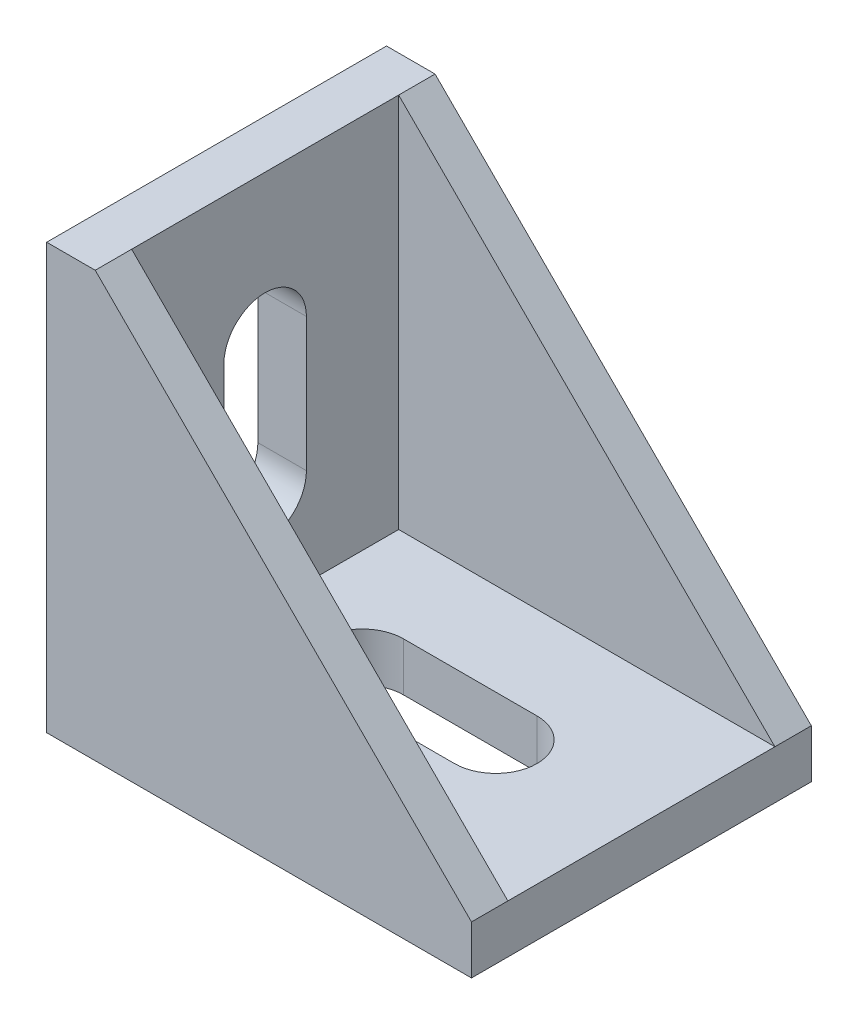
ISO-10303-21;
HEADER;
FILE_DESCRIPTION(('STEP AP214'),'2;1');
FILE_NAME('part.step','',(''),(''),'','','');
FILE_SCHEMA(('AUTOMOTIVE_DESIGN { 1 0 10303 214 1 1 1 1 }'));
ENDSEC;
DATA;
#1=APPLICATION_CONTEXT('core data for automotive mechanical design processes');
#2=APPLICATION_PROTOCOL_DEFINITION('international standard','automotive_design',2000,#1);
#3=PRODUCT_CONTEXT('',#1,'mechanical');
#4=PRODUCT('Part','Part','',(#3));
#5=PRODUCT_RELATED_PRODUCT_CATEGORY('part','',(#4));
#6=PRODUCT_DEFINITION_FORMATION('','',#4);
#7=PRODUCT_DEFINITION_CONTEXT('part definition',#1,'design');
#8=PRODUCT_DEFINITION('design','',#6,#7);
#9=PRODUCT_DEFINITION_SHAPE('','',#8);
#10=(LENGTH_UNIT() NAMED_UNIT(*) SI_UNIT(.MILLI.,.METRE.));
#11=(NAMED_UNIT(*) PLANE_ANGLE_UNIT() SI_UNIT($,.RADIAN.));
#12=(NAMED_UNIT(*) SI_UNIT($,.STERADIAN.) SOLID_ANGLE_UNIT());
#13=UNCERTAINTY_MEASURE_WITH_UNIT(LENGTH_MEASURE(1.E-05),#10,'distance_accuracy_value','');
#14=(GEOMETRIC_REPRESENTATION_CONTEXT(3) GLOBAL_UNCERTAINTY_ASSIGNED_CONTEXT((#13)) GLOBAL_UNIT_ASSIGNED_CONTEXT((#10,
#11,#12)) REPRESENTATION_CONTEXT('',''));
#15=CARTESIAN_POINT('',(0.,0.,0.));
#16=DIRECTION('',(0.,0.,1.));
#17=DIRECTION('',(1.,0.,0.));
#18=AXIS2_PLACEMENT_3D('',#15,#16,#17);
#19=CARTESIAN_POINT('',(4.,35.,14.));
#20=DIRECTION('',(-1.,0.,0.));
#21=DIRECTION('',(0.,-1.,0.));
#22=AXIS2_PLACEMENT_3D('',#19,#20,#21);
#23=PLANE('',#22);
#24=DIRECTION('',(0.,-1.,0.));
#25=VECTOR('',#24,1.);
#26=CARTESIAN_POINT('',(4.,4.,-11.));
#27=LINE('',#26,#25);
#28=CARTESIAN_POINT('',(4.,35.,-11.));
#29=VERTEX_POINT('',#28);
#30=CARTESIAN_POINT('',(4.,4.,-11.));
#31=VERTEX_POINT('',#30);
#32=EDGE_CURVE('E455',#29,#31,#27,.T.);
#33=ORIENTED_EDGE('',*,*,#32,.F.);
#34=DIRECTION('',(0.,0.,-1.));
#35=VECTOR('',#34,1.);
#36=CARTESIAN_POINT('',(4.,35.,14.));
#37=LINE('',#36,#35);
#38=CARTESIAN_POINT('',(4.,35.,11.));
#39=VERTEX_POINT('',#38);
#40=EDGE_CURVE('E495',#39,#29,#37,.T.);
#41=ORIENTED_EDGE('',*,*,#40,.F.);
#42=DIRECTION('',(0.,-1.,0.));
#43=VECTOR('',#42,1.);
#44=CARTESIAN_POINT('',(4.,4.,11.));
#45=LINE('',#44,#43);
#46=CARTESIAN_POINT('',(4.,4.,11.));
#47=VERTEX_POINT('',#46);
#48=EDGE_CURVE('E472',#39,#47,#45,.T.);
#49=ORIENTED_EDGE('',*,*,#48,.T.);
#50=DIRECTION('',(0.,0.,-1.));
#51=VECTOR('',#50,1.);
#52=CARTESIAN_POINT('',(4.,4.,14.));
#53=LINE('',#52,#51);
#54=EDGE_CURVE('E506',#47,#31,#53,.T.);
#55=ORIENTED_EDGE('',*,*,#54,.T.);
#56=EDGE_LOOP('',(#33,#41,#49,#55));
#57=FACE_BOUND('',#56,.T.);
#58=CARTESIAN_POINT('',(4.,12.,0.));
#59=DIRECTION('',(-1.,0.,0.));
#60=DIRECTION('',(0.,0.,1.));
#61=AXIS2_PLACEMENT_3D('',#58,#59,#60);
#62=CIRCLE('',#61,3.4);
#63=CARTESIAN_POINT('',(4.,12.,-3.4));
#64=VERTEX_POINT('',#63);
#65=CARTESIAN_POINT('',(4.,12.,3.4));
#66=VERTEX_POINT('',#65);
#67=EDGE_CURVE('E325',#64,#66,#62,.T.);
#68=ORIENTED_EDGE('',*,*,#67,.T.);
#69=DIRECTION('',(0.,1.,0.));
#70=VECTOR('',#69,1.);
#71=CARTESIAN_POINT('',(4.,12.,3.4));
#72=LINE('',#71,#70);
#73=CARTESIAN_POINT('',(4.00000000000001,23.,3.4));
#74=VERTEX_POINT('',#73);
#75=EDGE_CURVE('E329',#66,#74,#72,.T.);
#76=ORIENTED_EDGE('',*,*,#75,.T.);
#77=CARTESIAN_POINT('',(4.00000000000001,23.,0.));
#78=DIRECTION('',(-1.,0.,0.));
#79=DIRECTION('',(0.,0.,1.));
#80=AXIS2_PLACEMENT_3D('',#77,#78,#79);
#81=CIRCLE('',#80,3.4);
#82=CARTESIAN_POINT('',(4.00000000000001,23.,-3.4));
#83=VERTEX_POINT('',#82);
#84=EDGE_CURVE('E342',#74,#83,#81,.T.);
#85=ORIENTED_EDGE('',*,*,#84,.T.);
#86=DIRECTION('',(0.,-1.,0.));
#87=VECTOR('',#86,1.);
#88=CARTESIAN_POINT('',(4.,12.,-3.4));
#89=LINE('',#88,#87);
#90=EDGE_CURVE('E339',#83,#64,#89,.T.);
#91=ORIENTED_EDGE('',*,*,#90,.T.);
#92=EDGE_LOOP('',(#68,#76,#85,#91));
#93=FACE_BOUND('',#92,.T.);
#94=ADVANCED_FACE('F46',(#57,#93),#23,.F.);
#95=CARTESIAN_POINT('',(0.,35.,14.));
#96=DIRECTION('',(1.,0.,0.));
#97=DIRECTION('',(0.,1.,0.));
#98=AXIS2_PLACEMENT_3D('',#95,#96,#97);
#99=PLANE('',#98);
#100=DIRECTION('',(0.,1.,0.));
#101=VECTOR('',#100,1.);
#102=CARTESIAN_POINT('',(0.,29.5,-4.));
#103=LINE('',#102,#101);
#104=CARTESIAN_POINT('',(0.,29.5,-4.));
#105=VERTEX_POINT('',#104);
#106=CARTESIAN_POINT('',(0.,32.,-4.));
#107=VERTEX_POINT('',#106);
#108=EDGE_CURVE('E287',#105,#107,#103,.T.);
#109=ORIENTED_EDGE('',*,*,#108,.T.);
#110=DIRECTION('',(0.,0.,1.));
#111=VECTOR('',#110,1.);
#112=CARTESIAN_POINT('',(0.,32.,-4.));
#113=LINE('',#112,#111);
#114=CARTESIAN_POINT('',(0.,32.,4.));
#115=VERTEX_POINT('',#114);
#116=EDGE_CURVE('E261',#107,#115,#113,.T.);
#117=ORIENTED_EDGE('',*,*,#116,.T.);
#118=DIRECTION('',(0.,-1.,0.));
#119=VECTOR('',#118,1.);
#120=CARTESIAN_POINT('',(0.,29.5,4.));
#121=LINE('',#120,#119);
#122=CARTESIAN_POINT('',(0.,29.5,4.));
#123=VERTEX_POINT('',#122);
#124=EDGE_CURVE('E277',#115,#123,#121,.T.);
#125=ORIENTED_EDGE('',*,*,#124,.T.);
#126=DIRECTION('',(0.,0.,-1.));
#127=VECTOR('',#126,1.);
#128=CARTESIAN_POINT('',(0.,29.5,-4.));
#129=LINE('',#128,#127);
#130=EDGE_CURVE('E61',#123,#105,#129,.T.);
#131=ORIENTED_EDGE('',*,*,#130,.T.);
#132=EDGE_LOOP('',(#109,#117,#125,#131));
#133=FACE_BOUND('',#132,.T.);
#134=DIRECTION('',(0.,1.,0.));
#135=VECTOR('',#134,1.);
#136=CARTESIAN_POINT('',(0.,3.,-4.));
#137=LINE('',#136,#135);
#138=CARTESIAN_POINT('',(0.,3.,-4.));
#139=VERTEX_POINT('',#138);
#140=CARTESIAN_POINT('',(0.,5.5,-4.));
#141=VERTEX_POINT('',#140);
#142=EDGE_CURVE('E312',#139,#141,#137,.T.);
#143=ORIENTED_EDGE('',*,*,#142,.T.);
#144=DIRECTION('',(0.,0.,1.));
#145=VECTOR('',#144,1.);
#146=CARTESIAN_POINT('',(0.,5.5,-4.));
#147=LINE('',#146,#145);
#148=CARTESIAN_POINT('',(0.,5.5,4.));
#149=VERTEX_POINT('',#148);
#150=EDGE_CURVE('E266',#141,#149,#147,.T.);
#151=ORIENTED_EDGE('',*,*,#150,.T.);
#152=DIRECTION('',(0.,-1.,0.));
#153=VECTOR('',#152,1.);
#154=CARTESIAN_POINT('',(0.,3.,4.));
#155=LINE('',#154,#153);
#156=CARTESIAN_POINT('',(0.,3.,4.));
#157=VERTEX_POINT('',#156);
#158=EDGE_CURVE('E300',#149,#157,#155,.T.);
#159=ORIENTED_EDGE('',*,*,#158,.T.);
#160=DIRECTION('',(0.,0.,-1.));
#161=VECTOR('',#160,1.);
#162=CARTESIAN_POINT('',(0.,3.,-4.));
#163=LINE('',#162,#161);
#164=EDGE_CURVE('E69',#157,#139,#163,.T.);
#165=ORIENTED_EDGE('',*,*,#164,.T.);
#166=EDGE_LOOP('',(#143,#151,#159,#165));
#167=FACE_BOUND('',#166,.T.);
#168=DIRECTION('',(0.,-1.,0.));
#169=VECTOR('',#168,1.);
#170=CARTESIAN_POINT('',(0.,35.,-14.));
#171=LINE('',#170,#169);
#172=CARTESIAN_POINT('',(0.,35.,-14.));
#173=VERTEX_POINT('',#172);
#174=CARTESIAN_POINT('',(0.,0.,-14.));
#175=VERTEX_POINT('',#174);
#176=EDGE_CURVE('E498',#173,#175,#171,.T.);
#177=ORIENTED_EDGE('',*,*,#176,.T.);
#178=DIRECTION('',(0.,0.,-1.));
#179=VECTOR('',#178,1.);
#180=CARTESIAN_POINT('',(0.,0.,14.));
#181=LINE('',#180,#179);
#182=CARTESIAN_POINT('',(0.,0.,14.));
#183=VERTEX_POINT('',#182);
#184=EDGE_CURVE('E54',#183,#175,#181,.T.);
#185=ORIENTED_EDGE('',*,*,#184,.F.);
#186=DIRECTION('',(0.,-1.,0.));
#187=VECTOR('',#186,1.);
#188=CARTESIAN_POINT('',(0.,35.,14.));
#189=LINE('',#188,#187);
#190=CARTESIAN_POINT('',(0.,35.,14.));
#191=VERTEX_POINT('',#190);
#192=EDGE_CURVE('E487',#191,#183,#189,.T.);
#193=ORIENTED_EDGE('',*,*,#192,.F.);
#194=DIRECTION('',(0.,0.,-1.));
#195=VECTOR('',#194,1.);
#196=CARTESIAN_POINT('',(0.,35.,14.));
#197=LINE('',#196,#195);
#198=EDGE_CURVE('E13',#191,#173,#197,.T.);
#199=ORIENTED_EDGE('',*,*,#198,.T.);
#200=EDGE_LOOP('',(#177,#185,#193,#199));
#201=FACE_BOUND('',#200,.T.);
#202=CARTESIAN_POINT('',(0.,12.,0.));
#203=DIRECTION('',(-1.,0.,0.));
#204=DIRECTION('',(0.,0.,1.));
#205=AXIS2_PLACEMENT_3D('',#202,#203,#204);
#206=CIRCLE('',#205,3.4);
#207=CARTESIAN_POINT('',(0.,12.,-3.4));
#208=VERTEX_POINT('',#207);
#209=CARTESIAN_POINT('',(0.,12.,3.4));
#210=VERTEX_POINT('',#209);
#211=EDGE_CURVE('E326',#208,#210,#206,.T.);
#212=ORIENTED_EDGE('',*,*,#211,.F.);
#213=DIRECTION('',(0.,-1.,0.));
#214=VECTOR('',#213,1.);
#215=CARTESIAN_POINT('',(0.,12.,-3.4));
#216=LINE('',#215,#214);
#217=CARTESIAN_POINT('',(0.,23.,-3.4));
#218=VERTEX_POINT('',#217);
#219=EDGE_CURVE('E328',#218,#208,#216,.T.);
#220=ORIENTED_EDGE('',*,*,#219,.F.);
#221=CARTESIAN_POINT('',(0.,23.,0.));
#222=DIRECTION('',(-1.,0.,0.));
#223=DIRECTION('',(0.,0.,1.));
#224=AXIS2_PLACEMENT_3D('',#221,#222,#223);
#225=CIRCLE('',#224,3.4);
#226=CARTESIAN_POINT('',(0.,23.,3.4));
#227=VERTEX_POINT('',#226);
#228=EDGE_CURVE('E331',#227,#218,#225,.T.);
#229=ORIENTED_EDGE('',*,*,#228,.F.);
#230=DIRECTION('',(0.,1.,0.));
#231=VECTOR('',#230,1.);
#232=CARTESIAN_POINT('',(0.,12.,3.4));
#233=LINE('',#232,#231);
#234=EDGE_CURVE('E334',#210,#227,#233,.T.);
#235=ORIENTED_EDGE('',*,*,#234,.F.);
#236=EDGE_LOOP('',(#212,#220,#229,#235));
#237=FACE_BOUND('',#236,.T.);
#238=ADVANCED_FACE('F556',(#133,#167,#201,#237),#99,.F.);
#239=CARTESIAN_POINT('',(0.,0.,14.));
#240=DIRECTION('',(0.,1.,0.));
#241=DIRECTION('',(0.,0.,1.));
#242=AXIS2_PLACEMENT_3D('',#239,#240,#241);
#243=PLANE('',#242);
#244=DIRECTION('',(0.,0.,1.));
#245=VECTOR('',#244,1.);
#246=CARTESIAN_POINT('',(5.5,0.,-4.));
#247=LINE('',#246,#245);
#248=CARTESIAN_POINT('',(5.5,0.,-4.));
#249=VERTEX_POINT('',#248);
#250=CARTESIAN_POINT('',(5.5,0.,4.));
#251=VERTEX_POINT('',#250);
#252=EDGE_CURVE('E389',#249,#251,#247,.T.);
#253=ORIENTED_EDGE('',*,*,#252,.F.);
#254=DIRECTION('',(1.,0.,0.));
#255=VECTOR('',#254,1.);
#256=CARTESIAN_POINT('',(3.,0.,-4.));
#257=LINE('',#256,#255);
#258=CARTESIAN_POINT('',(3.,0.,-4.));
#259=VERTEX_POINT('',#258);
#260=EDGE_CURVE('E394',#259,#249,#257,.T.);
#261=ORIENTED_EDGE('',*,*,#260,.F.);
#262=DIRECTION('',(0.,0.,-1.));
#263=VECTOR('',#262,1.);
#264=CARTESIAN_POINT('',(3.,0.,-4.));
#265=LINE('',#264,#263);
#266=CARTESIAN_POINT('',(3.,0.,4.));
#267=VERTEX_POINT('',#266);
#268=EDGE_CURVE('E406',#267,#259,#265,.T.);
#269=ORIENTED_EDGE('',*,*,#268,.F.);
#270=DIRECTION('',(-1.,0.,0.));
#271=VECTOR('',#270,1.);
#272=CARTESIAN_POINT('',(3.,0.,4.));
#273=LINE('',#272,#271);
#274=EDGE_CURVE('E403',#251,#267,#273,.T.);
#275=ORIENTED_EDGE('',*,*,#274,.F.);
#276=EDGE_LOOP('',(#253,#261,#269,#275));
#277=FACE_BOUND('',#276,.T.);
#278=DIRECTION('',(-1.,0.,0.));
#279=VECTOR('',#278,1.);
#280=CARTESIAN_POINT('',(12.,0.,-3.4));
#281=LINE('',#280,#279);
#282=CARTESIAN_POINT('',(23.,0.,-3.4));
#283=VERTEX_POINT('',#282);
#284=CARTESIAN_POINT('',(12.,0.,-3.4));
#285=VERTEX_POINT('',#284);
#286=EDGE_CURVE('E433',#283,#285,#281,.T.);
#287=ORIENTED_EDGE('',*,*,#286,.T.);
#288=CARTESIAN_POINT('',(12.,0.,0.));
#289=DIRECTION('',(0.,1.,0.));
#290=DIRECTION('',(0.,0.,1.));
#291=AXIS2_PLACEMENT_3D('',#288,#289,#290);
#292=CIRCLE('',#291,3.4);
#293=CARTESIAN_POINT('',(12.,0.,3.4));
#294=VERTEX_POINT('',#293);
#295=EDGE_CURVE('E423',#285,#294,#292,.T.);
#296=ORIENTED_EDGE('',*,*,#295,.T.);
#297=DIRECTION('',(1.,0.,0.));
#298=VECTOR('',#297,1.);
#299=CARTESIAN_POINT('',(12.,0.,3.4));
#300=LINE('',#299,#298);
#301=CARTESIAN_POINT('',(23.,0.,3.4));
#302=VERTEX_POINT('',#301);
#303=EDGE_CURVE('E426',#294,#302,#300,.T.);
#304=ORIENTED_EDGE('',*,*,#303,.T.);
#305=CARTESIAN_POINT('',(23.,0.,0.));
#306=DIRECTION('',(0.,1.,0.));
#307=DIRECTION('',(0.,0.,1.));
#308=AXIS2_PLACEMENT_3D('',#305,#306,#307);
#309=CIRCLE('',#308,3.4);
#310=EDGE_CURVE('E430',#302,#283,#309,.T.);
#311=ORIENTED_EDGE('',*,*,#310,.T.);
#312=EDGE_LOOP('',(#287,#296,#304,#311));
#313=FACE_BOUND('',#312,.T.);
#314=DIRECTION('',(1.,0.,0.));
#315=VECTOR('',#314,1.);
#316=CARTESIAN_POINT('',(0.,0.,-14.));
#317=LINE('',#316,#315);
#318=CARTESIAN_POINT('',(35.,0.,-14.));
#319=VERTEX_POINT('',#318);
#320=EDGE_CURVE('E500',#175,#319,#317,.T.);
#321=ORIENTED_EDGE('',*,*,#320,.T.);
#322=DIRECTION('',(0.,0.,-1.));
#323=VECTOR('',#322,1.);
#324=CARTESIAN_POINT('',(35.,0.,14.));
#325=LINE('',#324,#323);
#326=CARTESIAN_POINT('',(35.,0.,14.));
#327=VERTEX_POINT('',#326);
#328=EDGE_CURVE('E512',#327,#319,#325,.T.);
#329=ORIENTED_EDGE('',*,*,#328,.F.);
#330=DIRECTION('',(1.,0.,0.));
#331=VECTOR('',#330,1.);
#332=CARTESIAN_POINT('',(0.,0.,14.));
#333=LINE('',#332,#331);
#334=EDGE_CURVE('E490',#183,#327,#333,.T.);
#335=ORIENTED_EDGE('',*,*,#334,.F.);
#336=ORIENTED_EDGE('',*,*,#184,.T.);
#337=EDGE_LOOP('',(#321,#329,#335,#336));
#338=FACE_BOUND('',#337,.T.);
#339=DIRECTION('',(0.,0.,1.));
#340=VECTOR('',#339,1.);
#341=CARTESIAN_POINT('',(32.,0.,-4.));
#342=LINE('',#341,#340);
#343=CARTESIAN_POINT('',(32.,0.,-4.));
#344=VERTEX_POINT('',#343);
#345=CARTESIAN_POINT('',(32.,0.,4.));
#346=VERTEX_POINT('',#345);
#347=EDGE_CURVE('E350',#344,#346,#342,.T.);
#348=ORIENTED_EDGE('',*,*,#347,.F.);
#349=DIRECTION('',(1.,0.,0.));
#350=VECTOR('',#349,1.);
#351=CARTESIAN_POINT('',(29.5,0.,-4.));
#352=LINE('',#351,#350);
#353=CARTESIAN_POINT('',(29.5,0.,-4.));
#354=VERTEX_POINT('',#353);
#355=EDGE_CURVE('E361',#354,#344,#352,.T.);
#356=ORIENTED_EDGE('',*,*,#355,.F.);
#357=DIRECTION('',(0.,0.,-1.));
#358=VECTOR('',#357,1.);
#359=CARTESIAN_POINT('',(29.5,0.,-4.));
#360=LINE('',#359,#358);
#361=CARTESIAN_POINT('',(29.5,0.,4.));
#362=VERTEX_POINT('',#361);
#363=EDGE_CURVE('E373',#362,#354,#360,.T.);
#364=ORIENTED_EDGE('',*,*,#363,.F.);
#365=DIRECTION('',(-1.,0.,0.));
#366=VECTOR('',#365,1.);
#367=CARTESIAN_POINT('',(29.5,0.,4.));
#368=LINE('',#367,#366);
#369=EDGE_CURVE('E370',#346,#362,#368,.T.);
#370=ORIENTED_EDGE('',*,*,#369,.F.);
#371=EDGE_LOOP('',(#348,#356,#364,#370));
#372=FACE_BOUND('',#371,.T.);
#373=ADVANCED_FACE('F519',(#277,#313,#338,#372),#243,.F.);
#374=CARTESIAN_POINT('',(4.,4.,14.));
#375=DIRECTION('',(0.,-1.,0.));
#376=DIRECTION('',(0.,0.,-1.));
#377=AXIS2_PLACEMENT_3D('',#374,#375,#376);
#378=PLANE('',#377);
#379=DIRECTION('',(1.,0.,0.));
#380=VECTOR('',#379,1.);
#381=CARTESIAN_POINT('',(12.,4.,3.4));
#382=LINE('',#381,#380);
#383=CARTESIAN_POINT('',(12.,4.,3.4));
#384=VERTEX_POINT('',#383);
#385=CARTESIAN_POINT('',(23.,4.,3.4));
#386=VERTEX_POINT('',#385);
#387=EDGE_CURVE('E438',#384,#386,#382,.T.);
#388=ORIENTED_EDGE('',*,*,#387,.F.);
#389=CARTESIAN_POINT('',(12.,4.,0.));
#390=DIRECTION('',(0.,1.,0.));
#391=DIRECTION('',(0.,0.,1.));
#392=AXIS2_PLACEMENT_3D('',#389,#390,#391);
#393=CIRCLE('',#392,3.4);
#394=CARTESIAN_POINT('',(12.,4.,-3.4));
#395=VERTEX_POINT('',#394);
#396=EDGE_CURVE('E422',#395,#384,#393,.T.);
#397=ORIENTED_EDGE('',*,*,#396,.F.);
#398=DIRECTION('',(-1.,0.,0.));
#399=VECTOR('',#398,1.);
#400=CARTESIAN_POINT('',(12.,4.,-3.4));
#401=LINE('',#400,#399);
#402=CARTESIAN_POINT('',(23.,4.,-3.4));
#403=VERTEX_POINT('',#402);
#404=EDGE_CURVE('E427',#403,#395,#401,.T.);
#405=ORIENTED_EDGE('',*,*,#404,.F.);
#406=CARTESIAN_POINT('',(23.,4.,0.));
#407=DIRECTION('',(0.,1.,0.));
#408=DIRECTION('',(0.,0.,1.));
#409=AXIS2_PLACEMENT_3D('',#406,#407,#408);
#410=CIRCLE('',#409,3.4);
#411=EDGE_CURVE('E441',#386,#403,#410,.T.);
#412=ORIENTED_EDGE('',*,*,#411,.F.);
#413=EDGE_LOOP('',(#388,#397,#405,#412));
#414=FACE_BOUND('',#413,.T.);
#415=DIRECTION('',(1.,0.,0.));
#416=VECTOR('',#415,1.);
#417=CARTESIAN_POINT('',(35.,4.,-11.));
#418=LINE('',#417,#416);
#419=CARTESIAN_POINT('',(35.,4.,-11.));
#420=VERTEX_POINT('',#419);
#421=EDGE_CURVE('E461',#31,#420,#418,.T.);
#422=ORIENTED_EDGE('',*,*,#421,.F.);
#423=ORIENTED_EDGE('',*,*,#54,.F.);
#424=DIRECTION('',(1.,0.,0.));
#425=VECTOR('',#424,1.);
#426=CARTESIAN_POINT('',(35.,4.,11.));
#427=LINE('',#426,#425);
#428=CARTESIAN_POINT('',(35.,4.,11.));
#429=VERTEX_POINT('',#428);
#430=EDGE_CURVE('E475',#47,#429,#427,.T.);
#431=ORIENTED_EDGE('',*,*,#430,.T.);
#432=DIRECTION('',(0.,0.,-1.));
#433=VECTOR('',#432,1.);
#434=CARTESIAN_POINT('',(35.,4.,14.));
#435=LINE('',#434,#433);
#436=EDGE_CURVE('E509',#429,#420,#435,.T.);
#437=ORIENTED_EDGE('',*,*,#436,.T.);
#438=EDGE_LOOP('',(#422,#423,#431,#437));
#439=FACE_BOUND('',#438,.T.);
#440=ADVANCED_FACE('F541',(#414,#439),#378,.F.);
#441=CARTESIAN_POINT('',(4.,35.,14.));
#442=DIRECTION('',(0.,-1.,0.));
#443=DIRECTION('',(0.,0.,-1.));
#444=AXIS2_PLACEMENT_3D('',#441,#442,#443);
#445=PLANE('',#444);
#446=DIRECTION('',(-1.,0.,0.));
#447=VECTOR('',#446,1.);
#448=CARTESIAN_POINT('',(4.,35.,-14.));
#449=LINE('',#448,#447);
#450=CARTESIAN_POINT('',(4.,35.,-14.));
#451=VERTEX_POINT('',#450);
#452=EDGE_CURVE('E481',#451,#173,#449,.T.);
#453=ORIENTED_EDGE('',*,*,#452,.T.);
#454=ORIENTED_EDGE('',*,*,#198,.F.);
#455=DIRECTION('',(-1.,0.,0.));
#456=VECTOR('',#455,1.);
#457=CARTESIAN_POINT('',(4.,35.,14.));
#458=LINE('',#457,#456);
#459=CARTESIAN_POINT('',(4.,35.,14.));
#460=VERTEX_POINT('',#459);
#461=EDGE_CURVE('E484',#460,#191,#458,.T.);
#462=ORIENTED_EDGE('',*,*,#461,.F.);
#463=EDGE_CURVE('E503',#460,#39,#37,.T.);
#464=ORIENTED_EDGE('',*,*,#463,.T.);
#465=ORIENTED_EDGE('',*,*,#40,.T.);
#466=DIRECTION('',(0.,0.,-1.));
#467=VECTOR('',#466,1.);
#468=CARTESIAN_POINT('',(4.,35.,-11.));
#469=LINE('',#468,#467);
#470=EDGE_CURVE('E464',#29,#451,#469,.T.);
#471=ORIENTED_EDGE('',*,*,#470,.T.);
#472=EDGE_LOOP('',(#453,#454,#462,#464,#465,#471));
#473=FACE_BOUND('',#472,.T.);
#474=ADVANCED_FACE('F48',(#473),#445,.F.);
#475=CARTESIAN_POINT('',(35.,0.,14.));
#476=DIRECTION('',(-1.,0.,0.));
#477=DIRECTION('',(0.,0.,1.));
#478=AXIS2_PLACEMENT_3D('',#475,#476,#477);
#479=PLANE('',#478);
#480=DIRECTION('',(0.,1.,0.));
#481=VECTOR('',#480,1.);
#482=CARTESIAN_POINT('',(35.,0.,-14.));
#483=LINE('',#482,#481);
#484=CARTESIAN_POINT('',(35.,4.,-14.));
#485=VERTEX_POINT('',#484);
#486=EDGE_CURVE('E488',#319,#485,#483,.T.);
#487=ORIENTED_EDGE('',*,*,#486,.T.);
#488=DIRECTION('',(0.,0.,-1.));
#489=VECTOR('',#488,1.);
#490=CARTESIAN_POINT('',(35.,4.,-11.));
#491=LINE('',#490,#489);
#492=EDGE_CURVE('E467',#420,#485,#491,.T.);
#493=ORIENTED_EDGE('',*,*,#492,.F.);
#494=ORIENTED_EDGE('',*,*,#436,.F.);
#495=CARTESIAN_POINT('',(35.,4.,14.));
#496=VERTEX_POINT('',#495);
#497=EDGE_CURVE('E510',#496,#429,#435,.T.);
#498=ORIENTED_EDGE('',*,*,#497,.F.);
#499=DIRECTION('',(0.,1.,0.));
#500=VECTOR('',#499,1.);
#501=CARTESIAN_POINT('',(35.,0.,14.));
#502=LINE('',#501,#500);
#503=EDGE_CURVE('E492',#327,#496,#502,.T.);
#504=ORIENTED_EDGE('',*,*,#503,.F.);
#505=ORIENTED_EDGE('',*,*,#328,.T.);
#506=EDGE_LOOP('',(#487,#493,#494,#498,#504,#505));
#507=FACE_BOUND('',#506,.T.);
#508=ADVANCED_FACE('F529',(#507),#479,.F.);
#509=CARTESIAN_POINT('',(0.,0.,14.));
#510=DIRECTION('',(0.,0.,1.));
#511=DIRECTION('',(1.,0.,0.));
#512=AXIS2_PLACEMENT_3D('',#509,#510,#511);
#513=PLANE('',#512);
#514=DIRECTION('',(-0.707106781186548,0.707106781186548,0.));
#515=VECTOR('',#514,1.);
#516=CARTESIAN_POINT('',(4.,35.,14.));
#517=LINE('',#516,#515);
#518=EDGE_CURVE('E470',#496,#460,#517,.T.);
#519=ORIENTED_EDGE('',*,*,#518,.T.);
#520=ORIENTED_EDGE('',*,*,#461,.T.);
#521=ORIENTED_EDGE('',*,*,#192,.T.);
#522=ORIENTED_EDGE('',*,*,#334,.T.);
#523=ORIENTED_EDGE('',*,*,#503,.T.);
#524=EDGE_LOOP('',(#519,#520,#521,#522,#523));
#525=FACE_BOUND('',#524,.T.);
#526=ADVANCED_FACE('F553',(#525),#513,.T.);
#527=CARTESIAN_POINT('',(0.,0.,-14.));
#528=DIRECTION('',(0.,0.,1.));
#529=DIRECTION('',(1.,0.,0.));
#530=AXIS2_PLACEMENT_3D('',#527,#528,#529);
#531=PLANE('',#530);
#532=ORIENTED_EDGE('',*,*,#452,.F.);
#533=DIRECTION('',(-0.707106781186548,0.707106781186548,0.));
#534=VECTOR('',#533,1.);
#535=CARTESIAN_POINT('',(4.,35.,-14.));
#536=LINE('',#535,#534);
#537=EDGE_CURVE('E448',#485,#451,#536,.T.);
#538=ORIENTED_EDGE('',*,*,#537,.F.);
#539=ORIENTED_EDGE('',*,*,#486,.F.);
#540=ORIENTED_EDGE('',*,*,#320,.F.);
#541=ORIENTED_EDGE('',*,*,#176,.F.);
#542=EDGE_LOOP('',(#532,#538,#539,#540,#541));
#543=FACE_BOUND('',#542,.T.);
#544=ADVANCED_FACE('F526',(#543),#531,.F.);
#545=CARTESIAN_POINT('',(4.,35.,11.));
#546=DIRECTION('',(0.707106781186547,0.707106781186547,0.));
#547=DIRECTION('',(-0.707106781186548,0.707106781186548,0.));
#548=AXIS2_PLACEMENT_3D('',#545,#546,#547);
#549=PLANE('',#548);
#550=ORIENTED_EDGE('',*,*,#518,.F.);
#551=ORIENTED_EDGE('',*,*,#497,.T.);
#552=DIRECTION('',(-0.707106781186548,0.707106781186548,0.));
#553=VECTOR('',#552,1.);
#554=CARTESIAN_POINT('',(4.,35.,11.));
#555=LINE('',#554,#553);
#556=EDGE_CURVE('E478',#429,#39,#555,.T.);
#557=ORIENTED_EDGE('',*,*,#556,.T.);
#558=ORIENTED_EDGE('',*,*,#463,.F.);
#559=EDGE_LOOP('',(#550,#551,#557,#558));
#560=FACE_BOUND('',#559,.T.);
#561=ADVANCED_FACE('F550',(#560),#549,.T.);
#562=CARTESIAN_POINT('',(0.,0.,11.));
#563=DIRECTION('',(0.,0.,1.));
#564=DIRECTION('',(1.,0.,0.));
#565=AXIS2_PLACEMENT_3D('',#562,#563,#564);
#566=PLANE('',#565);
#567=ORIENTED_EDGE('',*,*,#48,.F.);
#568=ORIENTED_EDGE('',*,*,#556,.F.);
#569=ORIENTED_EDGE('',*,*,#430,.F.);
#570=EDGE_LOOP('',(#567,#568,#569));
#571=FACE_BOUND('',#570,.T.);
#572=ADVANCED_FACE('F548',(#571),#566,.F.);
#573=CARTESIAN_POINT('',(4.,35.,-11.));
#574=DIRECTION('',(-0.707106781186547,-0.707106781186547,0.));
#575=DIRECTION('',(0.707106781186548,-0.707106781186548,0.));
#576=AXIS2_PLACEMENT_3D('',#573,#574,#575);
#577=PLANE('',#576);
#578=ORIENTED_EDGE('',*,*,#537,.T.);
#579=ORIENTED_EDGE('',*,*,#470,.F.);
#580=DIRECTION('',(-0.707106781186548,0.707106781186548,0.));
#581=VECTOR('',#580,1.);
#582=CARTESIAN_POINT('',(4.,35.,-11.));
#583=LINE('',#582,#581);
#584=EDGE_CURVE('E458',#420,#29,#583,.T.);
#585=ORIENTED_EDGE('',*,*,#584,.F.);
#586=ORIENTED_EDGE('',*,*,#492,.T.);
#587=EDGE_LOOP('',(#578,#579,#585,#586));
#588=FACE_BOUND('',#587,.T.);
#589=ADVANCED_FACE('F535',(#588),#577,.F.);
#590=CARTESIAN_POINT('',(0.,0.,-11.));
#591=DIRECTION('',(0.,0.,-1.));
#592=DIRECTION('',(1.,0.,0.));
#593=AXIS2_PLACEMENT_3D('',#590,#591,#592);
#594=PLANE('',#593);
#595=ORIENTED_EDGE('',*,*,#32,.T.);
#596=ORIENTED_EDGE('',*,*,#421,.T.);
#597=ORIENTED_EDGE('',*,*,#584,.T.);
#598=EDGE_LOOP('',(#595,#596,#597));
#599=FACE_BOUND('',#598,.T.);
#600=ADVANCED_FACE('F538',(#599),#594,.F.);
#601=CARTESIAN_POINT('',(12.,0.,0.));
#602=DIRECTION('',(0.,1.,0.));
#603=DIRECTION('',(0.,0.,1.));
#604=AXIS2_PLACEMENT_3D('',#601,#602,#603);
#605=CYLINDRICAL_SURFACE('',#604,3.4);
#606=ORIENTED_EDGE('',*,*,#396,.T.);
#607=DIRECTION('',(0.,1.,0.));
#608=VECTOR('',#607,1.);
#609=CARTESIAN_POINT('',(12.,0.,3.4));
#610=LINE('',#609,#608);
#611=EDGE_CURVE('E436',#294,#384,#610,.T.);
#612=ORIENTED_EDGE('',*,*,#611,.F.);
#613=ORIENTED_EDGE('',*,*,#295,.F.);
#614=DIRECTION('',(0.,1.,0.));
#615=VECTOR('',#614,1.);
#616=CARTESIAN_POINT('',(12.,0.,-3.4));
#617=LINE('',#616,#615);
#618=EDGE_CURVE('E446',#285,#395,#617,.T.);
#619=ORIENTED_EDGE('',*,*,#618,.T.);
#620=EDGE_LOOP('',(#606,#612,#613,#619));
#621=FACE_BOUND('',#620,.T.);
#622=ADVANCED_FACE('F588',(#621),#605,.F.);
#623=CARTESIAN_POINT('',(12.,0.,-3.4));
#624=DIRECTION('',(0.,0.,-1.));
#625=DIRECTION('',(-1.,0.,0.));
#626=AXIS2_PLACEMENT_3D('',#623,#624,#625);
#627=PLANE('',#626);
#628=ORIENTED_EDGE('',*,*,#404,.T.);
#629=ORIENTED_EDGE('',*,*,#618,.F.);
#630=ORIENTED_EDGE('',*,*,#286,.F.);
#631=DIRECTION('',(0.,1.,0.));
#632=VECTOR('',#631,1.);
#633=CARTESIAN_POINT('',(23.,0.,-3.4));
#634=LINE('',#633,#632);
#635=EDGE_CURVE('E449',#283,#403,#634,.T.);
#636=ORIENTED_EDGE('',*,*,#635,.T.);
#637=EDGE_LOOP('',(#628,#629,#630,#636));
#638=FACE_BOUND('',#637,.T.);
#639=ADVANCED_FACE('F584',(#638),#627,.F.);
#640=CARTESIAN_POINT('',(23.,0.,0.));
#641=DIRECTION('',(0.,1.,0.));
#642=DIRECTION('',(0.,0.,1.));
#643=AXIS2_PLACEMENT_3D('',#640,#641,#642);
#644=CYLINDRICAL_SURFACE('',#643,3.4);
#645=ORIENTED_EDGE('',*,*,#411,.T.);
#646=ORIENTED_EDGE('',*,*,#635,.F.);
#647=ORIENTED_EDGE('',*,*,#310,.F.);
#648=DIRECTION('',(0.,1.,0.));
#649=VECTOR('',#648,1.);
#650=CARTESIAN_POINT('',(23.,0.,3.4));
#651=LINE('',#650,#649);
#652=EDGE_CURVE('E451',#302,#386,#651,.T.);
#653=ORIENTED_EDGE('',*,*,#652,.T.);
#654=EDGE_LOOP('',(#645,#646,#647,#653));
#655=FACE_BOUND('',#654,.T.);
#656=ADVANCED_FACE('F596',(#655),#644,.F.);
#657=CARTESIAN_POINT('',(12.,0.,3.4));
#658=DIRECTION('',(0.,0.,1.));
#659=DIRECTION('',(1.,0.,0.));
#660=AXIS2_PLACEMENT_3D('',#657,#658,#659);
#661=PLANE('',#660);
#662=ORIENTED_EDGE('',*,*,#387,.T.);
#663=ORIENTED_EDGE('',*,*,#652,.F.);
#664=ORIENTED_EDGE('',*,*,#303,.F.);
#665=ORIENTED_EDGE('',*,*,#611,.T.);
#666=EDGE_LOOP('',(#662,#663,#664,#665));
#667=FACE_BOUND('',#666,.T.);
#668=ADVANCED_FACE('F593',(#667),#661,.F.);
#669=CARTESIAN_POINT('',(5.5,-2.5,-4.));
#670=DIRECTION('',(-1.,0.,0.));
#671=DIRECTION('',(0.,0.,1.));
#672=AXIS2_PLACEMENT_3D('',#669,#670,#671);
#673=PLANE('',#672);
#674=ORIENTED_EDGE('',*,*,#252,.T.);
#675=DIRECTION('',(0.,1.,0.));
#676=VECTOR('',#675,1.);
#677=CARTESIAN_POINT('',(5.5,-2.5,4.));
#678=LINE('',#677,#676);
#679=CARTESIAN_POINT('',(5.5,-2.5,4.));
#680=VERTEX_POINT('',#679);
#681=EDGE_CURVE('E419',#680,#251,#678,.T.);
#682=ORIENTED_EDGE('',*,*,#681,.F.);
#683=DIRECTION('',(0.,0.,1.));
#684=VECTOR('',#683,1.);
#685=CARTESIAN_POINT('',(5.5,-2.5,-4.));
#686=LINE('',#685,#684);
#687=CARTESIAN_POINT('',(5.5,-2.5,-4.));
#688=VERTEX_POINT('',#687);
#689=EDGE_CURVE('E390',#688,#680,#686,.T.);
#690=ORIENTED_EDGE('',*,*,#689,.F.);
#691=DIRECTION('',(0.,1.,0.));
#692=VECTOR('',#691,1.);
#693=CARTESIAN_POINT('',(5.5,-2.5,-4.));
#694=LINE('',#693,#692);
#695=EDGE_CURVE('E400',#688,#249,#694,.T.);
#696=ORIENTED_EDGE('',*,*,#695,.T.);
#697=EDGE_LOOP('',(#674,#682,#690,#696));
#698=FACE_BOUND('',#697,.T.);
#699=ADVANCED_FACE('F603',(#698),#673,.F.);
#700=CARTESIAN_POINT('',(3.,-2.5,4.));
#701=DIRECTION('',(0.,0.,-1.));
#702=DIRECTION('',(-1.,0.,0.));
#703=AXIS2_PLACEMENT_3D('',#700,#701,#702);
#704=PLANE('',#703);
#705=ORIENTED_EDGE('',*,*,#274,.T.);
#706=DIRECTION('',(0.,1.,0.));
#707=VECTOR('',#706,1.);
#708=CARTESIAN_POINT('',(3.,-2.5,4.));
#709=LINE('',#708,#707);
#710=CARTESIAN_POINT('',(3.,-2.5,4.));
#711=VERTEX_POINT('',#710);
#712=EDGE_CURVE('E416',#711,#267,#709,.T.);
#713=ORIENTED_EDGE('',*,*,#712,.F.);
#714=DIRECTION('',(-1.,0.,0.));
#715=VECTOR('',#714,1.);
#716=CARTESIAN_POINT('',(3.,-2.5,4.));
#717=LINE('',#716,#715);
#718=EDGE_CURVE('E393',#680,#711,#717,.T.);
#719=ORIENTED_EDGE('',*,*,#718,.F.);
#720=ORIENTED_EDGE('',*,*,#681,.T.);
#721=EDGE_LOOP('',(#705,#713,#719,#720));
#722=FACE_BOUND('',#721,.T.);
#723=ADVANCED_FACE('F672',(#722),#704,.F.);
#724=CARTESIAN_POINT('',(3.,-2.5,-4.));
#725=DIRECTION('',(1.,0.,0.));
#726=DIRECTION('',(0.,0.,-1.));
#727=AXIS2_PLACEMENT_3D('',#724,#725,#726);
#728=PLANE('',#727);
#729=ORIENTED_EDGE('',*,*,#268,.T.);
#730=DIRECTION('',(0.,1.,0.));
#731=VECTOR('',#730,1.);
#732=CARTESIAN_POINT('',(3.,-2.5,-4.));
#733=LINE('',#732,#731);
#734=CARTESIAN_POINT('',(3.,-2.5,-4.));
#735=VERTEX_POINT('',#734);
#736=EDGE_CURVE('E413',#735,#259,#733,.T.);
#737=ORIENTED_EDGE('',*,*,#736,.F.);
#738=DIRECTION('',(0.,0.,-1.));
#739=VECTOR('',#738,1.);
#740=CARTESIAN_POINT('',(3.,-2.5,-4.));
#741=LINE('',#740,#739);
#742=EDGE_CURVE('E396',#711,#735,#741,.T.);
#743=ORIENTED_EDGE('',*,*,#742,.F.);
#744=ORIENTED_EDGE('',*,*,#712,.T.);
#745=EDGE_LOOP('',(#729,#737,#743,#744));
#746=FACE_BOUND('',#745,.T.);
#747=ADVANCED_FACE('F681',(#746),#728,.F.);
#748=CARTESIAN_POINT('',(3.,-2.5,-4.));
#749=DIRECTION('',(0.,0.,1.));
#750=DIRECTION('',(1.,0.,0.));
#751=AXIS2_PLACEMENT_3D('',#748,#749,#750);
#752=PLANE('',#751);
#753=ORIENTED_EDGE('',*,*,#260,.T.);
#754=ORIENTED_EDGE('',*,*,#695,.F.);
#755=DIRECTION('',(1.,0.,0.));
#756=VECTOR('',#755,1.);
#757=CARTESIAN_POINT('',(3.,-2.5,-4.));
#758=LINE('',#757,#756);
#759=EDGE_CURVE('E398',#735,#688,#758,.T.);
#760=ORIENTED_EDGE('',*,*,#759,.F.);
#761=ORIENTED_EDGE('',*,*,#736,.T.);
#762=EDGE_LOOP('',(#753,#754,#760,#761));
#763=FACE_BOUND('',#762,.T.);
#764=ADVANCED_FACE('F691',(#763),#752,.F.);
#765=CARTESIAN_POINT('',(0.,-2.5,0.));
#766=DIRECTION('',(0.,1.,0.));
#767=DIRECTION('',(0.,0.,1.));
#768=AXIS2_PLACEMENT_3D('',#765,#766,#767);
#769=PLANE('',#768);
#770=ORIENTED_EDGE('',*,*,#689,.T.);
#771=ORIENTED_EDGE('',*,*,#718,.T.);
#772=ORIENTED_EDGE('',*,*,#742,.T.);
#773=ORIENTED_EDGE('',*,*,#759,.T.);
#774=EDGE_LOOP('',(#770,#771,#772,#773));
#775=FACE_BOUND('',#774,.T.);
#776=ADVANCED_FACE('F701',(#775),#769,.F.);
#777=CARTESIAN_POINT('',(32.,-2.5,-4.));
#778=DIRECTION('',(-1.,0.,0.));
#779=DIRECTION('',(0.,0.,1.));
#780=AXIS2_PLACEMENT_3D('',#777,#778,#779);
#781=PLANE('',#780);
#782=ORIENTED_EDGE('',*,*,#347,.T.);
#783=DIRECTION('',(0.,1.,0.));
#784=VECTOR('',#783,1.);
#785=CARTESIAN_POINT('',(32.,-2.5,4.));
#786=LINE('',#785,#784);
#787=CARTESIAN_POINT('',(32.,-2.5,4.));
#788=VERTEX_POINT('',#787);
#789=EDGE_CURVE('E386',#788,#346,#786,.T.);
#790=ORIENTED_EDGE('',*,*,#789,.F.);
#791=DIRECTION('',(0.,0.,1.));
#792=VECTOR('',#791,1.);
#793=CARTESIAN_POINT('',(32.,-2.5,-4.));
#794=LINE('',#793,#792);
#795=CARTESIAN_POINT('',(32.,-2.5,-4.));
#796=VERTEX_POINT('',#795);
#797=EDGE_CURVE('E357',#796,#788,#794,.T.);
#798=ORIENTED_EDGE('',*,*,#797,.F.);
#799=DIRECTION('',(0.,1.,0.));
#800=VECTOR('',#799,1.);
#801=CARTESIAN_POINT('',(32.,-2.5,-4.));
#802=LINE('',#801,#800);
#803=EDGE_CURVE('E367',#796,#344,#802,.T.);
#804=ORIENTED_EDGE('',*,*,#803,.T.);
#805=EDGE_LOOP('',(#782,#790,#798,#804));
#806=FACE_BOUND('',#805,.T.);
#807=ADVANCED_FACE('F711',(#806),#781,.F.);
#808=CARTESIAN_POINT('',(29.5,-2.5,4.));
#809=DIRECTION('',(0.,0.,-1.));
#810=DIRECTION('',(-1.,0.,0.));
#811=AXIS2_PLACEMENT_3D('',#808,#809,#810);
#812=PLANE('',#811);
#813=ORIENTED_EDGE('',*,*,#369,.T.);
#814=DIRECTION('',(0.,1.,0.));
#815=VECTOR('',#814,1.);
#816=CARTESIAN_POINT('',(29.5,-2.5,4.));
#817=LINE('',#816,#815);
#818=CARTESIAN_POINT('',(29.5,-2.5,4.));
#819=VERTEX_POINT('',#818);
#820=EDGE_CURVE('E383',#819,#362,#817,.T.);
#821=ORIENTED_EDGE('',*,*,#820,.F.);
#822=DIRECTION('',(-1.,0.,0.));
#823=VECTOR('',#822,1.);
#824=CARTESIAN_POINT('',(29.5,-2.5,4.));
#825=LINE('',#824,#823);
#826=EDGE_CURVE('E360',#788,#819,#825,.T.);
#827=ORIENTED_EDGE('',*,*,#826,.F.);
#828=ORIENTED_EDGE('',*,*,#789,.T.);
#829=EDGE_LOOP('',(#813,#821,#827,#828));
#830=FACE_BOUND('',#829,.T.);
#831=ADVANCED_FACE('F721',(#830),#812,.F.);
#832=CARTESIAN_POINT('',(29.5,-2.5,-4.));
#833=DIRECTION('',(1.,0.,0.));
#834=DIRECTION('',(0.,0.,-1.));
#835=AXIS2_PLACEMENT_3D('',#832,#833,#834);
#836=PLANE('',#835);
#837=ORIENTED_EDGE('',*,*,#363,.T.);
#838=DIRECTION('',(0.,1.,0.));
#839=VECTOR('',#838,1.);
#840=CARTESIAN_POINT('',(29.5,-2.5,-4.));
#841=LINE('',#840,#839);
#842=CARTESIAN_POINT('',(29.5,-2.5,-4.));
#843=VERTEX_POINT('',#842);
#844=EDGE_CURVE('E380',#843,#354,#841,.T.);
#845=ORIENTED_EDGE('',*,*,#844,.F.);
#846=DIRECTION('',(0.,0.,-1.));
#847=VECTOR('',#846,1.);
#848=CARTESIAN_POINT('',(29.5,-2.5,-4.));
#849=LINE('',#848,#847);
#850=EDGE_CURVE('E363',#819,#843,#849,.T.);
#851=ORIENTED_EDGE('',*,*,#850,.F.);
#852=ORIENTED_EDGE('',*,*,#820,.T.);
#853=EDGE_LOOP('',(#837,#845,#851,#852));
#854=FACE_BOUND('',#853,.T.);
#855=ADVANCED_FACE('F731',(#854),#836,.F.);
#856=CARTESIAN_POINT('',(29.5,-2.5,-4.));
#857=DIRECTION('',(0.,0.,1.));
#858=DIRECTION('',(1.,0.,0.));
#859=AXIS2_PLACEMENT_3D('',#856,#857,#858);
#860=PLANE('',#859);
#861=ORIENTED_EDGE('',*,*,#355,.T.);
#862=ORIENTED_EDGE('',*,*,#803,.F.);
#863=DIRECTION('',(1.,0.,0.));
#864=VECTOR('',#863,1.);
#865=CARTESIAN_POINT('',(29.5,-2.5,-4.));
#866=LINE('',#865,#864);
#867=EDGE_CURVE('E365',#843,#796,#866,.T.);
#868=ORIENTED_EDGE('',*,*,#867,.F.);
#869=ORIENTED_EDGE('',*,*,#844,.T.);
#870=EDGE_LOOP('',(#861,#862,#868,#869));
#871=FACE_BOUND('',#870,.T.);
#872=ADVANCED_FACE('F741',(#871),#860,.F.);
#873=CARTESIAN_POINT('',(0.,-2.5,0.));
#874=DIRECTION('',(0.,1.,0.));
#875=DIRECTION('',(0.,0.,1.));
#876=AXIS2_PLACEMENT_3D('',#873,#874,#875);
#877=PLANE('',#876);
#878=ORIENTED_EDGE('',*,*,#797,.T.);
#879=ORIENTED_EDGE('',*,*,#826,.T.);
#880=ORIENTED_EDGE('',*,*,#850,.T.);
#881=ORIENTED_EDGE('',*,*,#867,.T.);
#882=EDGE_LOOP('',(#878,#879,#880,#881));
#883=FACE_BOUND('',#882,.T.);
#884=ADVANCED_FACE('F751',(#883),#877,.F.);
#885=CARTESIAN_POINT('',(0.,12.,0.));
#886=DIRECTION('',(1.,0.,0.));
#887=DIRECTION('',(0.,1.,0.));
#888=AXIS2_PLACEMENT_3D('',#885,#886,#887);
#889=CYLINDRICAL_SURFACE('',#888,3.4);
#890=ORIENTED_EDGE('',*,*,#67,.F.);
#891=DIRECTION('',(1.,0.,0.));
#892=VECTOR('',#891,1.);
#893=CARTESIAN_POINT('',(0.,12.,-3.4));
#894=LINE('',#893,#892);
#895=EDGE_CURVE('E336',#208,#64,#894,.T.);
#896=ORIENTED_EDGE('',*,*,#895,.F.);
#897=ORIENTED_EDGE('',*,*,#211,.T.);
#898=DIRECTION('',(1.,0.,0.));
#899=VECTOR('',#898,1.);
#900=CARTESIAN_POINT('',(0.,12.,3.4));
#901=LINE('',#900,#899);
#902=EDGE_CURVE('E347',#210,#66,#901,.T.);
#903=ORIENTED_EDGE('',*,*,#902,.T.);
#904=EDGE_LOOP('',(#890,#896,#897,#903));
#905=FACE_BOUND('',#904,.T.);
#906=ADVANCED_FACE('F760',(#905),#889,.F.);
#907=CARTESIAN_POINT('',(0.,12.,3.4));
#908=DIRECTION('',(0.,0.,-1.));
#909=DIRECTION('',(-1.,0.,0.));
#910=AXIS2_PLACEMENT_3D('',#907,#908,#909);
#911=PLANE('',#910);
#912=ORIENTED_EDGE('',*,*,#75,.F.);
#913=ORIENTED_EDGE('',*,*,#902,.F.);
#914=ORIENTED_EDGE('',*,*,#234,.T.);
#915=DIRECTION('',(1.,0.,0.));
#916=VECTOR('',#915,1.);
#917=CARTESIAN_POINT('',(0.,23.,3.4));
#918=LINE('',#917,#916);
#919=EDGE_CURVE('E351',#227,#74,#918,.T.);
#920=ORIENTED_EDGE('',*,*,#919,.T.);
#921=EDGE_LOOP('',(#912,#913,#914,#920));
#922=FACE_BOUND('',#921,.T.);
#923=ADVANCED_FACE('F781',(#922),#911,.T.);
#924=CARTESIAN_POINT('',(0.,23.,0.));
#925=DIRECTION('',(1.,0.,0.));
#926=DIRECTION('',(0.,1.,0.));
#927=AXIS2_PLACEMENT_3D('',#924,#925,#926);
#928=CYLINDRICAL_SURFACE('',#927,3.4);
#929=ORIENTED_EDGE('',*,*,#84,.F.);
#930=ORIENTED_EDGE('',*,*,#919,.F.);
#931=ORIENTED_EDGE('',*,*,#228,.T.);
#932=DIRECTION('',(1.,0.,0.));
#933=VECTOR('',#932,1.);
#934=CARTESIAN_POINT('',(0.,23.,-3.4));
#935=LINE('',#934,#933);
#936=EDGE_CURVE('E353',#218,#83,#935,.T.);
#937=ORIENTED_EDGE('',*,*,#936,.T.);
#938=EDGE_LOOP('',(#929,#930,#931,#937));
#939=FACE_BOUND('',#938,.T.);
#940=ADVANCED_FACE('F791',(#939),#928,.F.);
#941=CARTESIAN_POINT('',(0.,12.,-3.4));
#942=DIRECTION('',(0.,0.,1.));
#943=DIRECTION('',(1.,0.,0.));
#944=AXIS2_PLACEMENT_3D('',#941,#942,#943);
#945=PLANE('',#944);
#946=ORIENTED_EDGE('',*,*,#90,.F.);
#947=ORIENTED_EDGE('',*,*,#936,.F.);
#948=ORIENTED_EDGE('',*,*,#219,.T.);
#949=ORIENTED_EDGE('',*,*,#895,.T.);
#950=EDGE_LOOP('',(#946,#947,#948,#949));
#951=FACE_BOUND('',#950,.T.);
#952=ADVANCED_FACE('F801',(#951),#945,.T.);
#953=CARTESIAN_POINT('',(-2.5,5.5,-4.));
#954=DIRECTION('',(0.,1.,0.));
#955=DIRECTION('',(-1.,0.,0.));
#956=AXIS2_PLACEMENT_3D('',#953,#954,#955);
#957=PLANE('',#956);
#958=ORIENTED_EDGE('',*,*,#150,.F.);
#959=DIRECTION('',(1.,0.,0.));
#960=VECTOR('',#959,1.);
#961=CARTESIAN_POINT('',(-2.5,5.5,-4.));
#962=LINE('',#961,#960);
#963=CARTESIAN_POINT('',(-2.5,5.5,-4.));
#964=VERTEX_POINT('',#963);
#965=EDGE_CURVE('E323',#964,#141,#962,.T.);
#966=ORIENTED_EDGE('',*,*,#965,.F.);
#967=DIRECTION('',(0.,0.,1.));
#968=VECTOR('',#967,1.);
#969=CARTESIAN_POINT('',(-2.5,5.5,-4.));
#970=LINE('',#969,#968);
#971=CARTESIAN_POINT('',(-2.5,5.5,4.));
#972=VERTEX_POINT('',#971);
#973=EDGE_CURVE('E296',#964,#972,#970,.T.);
#974=ORIENTED_EDGE('',*,*,#973,.T.);
#975=DIRECTION('',(1.,0.,0.));
#976=VECTOR('',#975,1.);
#977=CARTESIAN_POINT('',(-2.5,5.5,4.));
#978=LINE('',#977,#976);
#979=EDGE_CURVE('E309',#972,#149,#978,.T.);
#980=ORIENTED_EDGE('',*,*,#979,.T.);
#981=EDGE_LOOP('',(#958,#966,#974,#980));
#982=FACE_BOUND('',#981,.T.);
#983=ADVANCED_FACE('F811',(#982),#957,.T.);
#984=CARTESIAN_POINT('',(-2.5,3.,-4.));
#985=DIRECTION('',(0.,0.,-1.));
#986=DIRECTION('',(0.,1.,0.));
#987=AXIS2_PLACEMENT_3D('',#984,#985,#986);
#988=PLANE('',#987);
#989=ORIENTED_EDGE('',*,*,#142,.F.);
#990=DIRECTION('',(1.,0.,0.));
#991=VECTOR('',#990,1.);
#992=CARTESIAN_POINT('',(-2.5,3.,-4.));
#993=LINE('',#992,#991);
#994=CARTESIAN_POINT('',(-2.5,3.,-4.));
#995=VERTEX_POINT('',#994);
#996=EDGE_CURVE('E321',#995,#139,#993,.T.);
#997=ORIENTED_EDGE('',*,*,#996,.F.);
#998=DIRECTION('',(0.,1.,0.));
#999=VECTOR('',#998,1.);
#1000=CARTESIAN_POINT('',(-2.5,3.,-4.));
#1001=LINE('',#1000,#999);
#1002=EDGE_CURVE('E299',#995,#964,#1001,.T.);
#1003=ORIENTED_EDGE('',*,*,#1002,.T.);
#1004=ORIENTED_EDGE('',*,*,#965,.T.);
#1005=EDGE_LOOP('',(#989,#997,#1003,#1004));
#1006=FACE_BOUND('',#1005,.T.);
#1007=ADVANCED_FACE('F821',(#1006),#988,.T.);
#1008=CARTESIAN_POINT('',(-2.5,3.,-4.));
#1009=DIRECTION('',(0.,-1.,0.));
#1010=DIRECTION('',(1.,0.,0.));
#1011=AXIS2_PLACEMENT_3D('',#1008,#1009,#1010);
#1012=PLANE('',#1011);
#1013=ORIENTED_EDGE('',*,*,#164,.F.);
#1014=DIRECTION('',(1.,0.,0.));
#1015=VECTOR('',#1014,1.);
#1016=CARTESIAN_POINT('',(-2.5,3.,4.));
#1017=LINE('',#1016,#1015);
#1018=CARTESIAN_POINT('',(-2.5,3.,4.));
#1019=VERTEX_POINT('',#1018);
#1020=EDGE_CURVE('E319',#1019,#157,#1017,.T.);
#1021=ORIENTED_EDGE('',*,*,#1020,.F.);
#1022=DIRECTION('',(0.,0.,-1.));
#1023=VECTOR('',#1022,1.);
#1024=CARTESIAN_POINT('',(-2.5,3.,-4.));
#1025=LINE('',#1024,#1023);
#1026=EDGE_CURVE('E303',#1019,#995,#1025,.T.);
#1027=ORIENTED_EDGE('',*,*,#1026,.T.);
#1028=ORIENTED_EDGE('',*,*,#996,.T.);
#1029=EDGE_LOOP('',(#1013,#1021,#1027,#1028));
#1030=FACE_BOUND('',#1029,.T.);
#1031=ADVANCED_FACE('F831',(#1030),#1012,.T.);
#1032=CARTESIAN_POINT('',(-2.5,3.,4.));
#1033=DIRECTION('',(0.,0.,1.));
#1034=DIRECTION('',(0.,-1.,0.));
#1035=AXIS2_PLACEMENT_3D('',#1032,#1033,#1034);
#1036=PLANE('',#1035);
#1037=ORIENTED_EDGE('',*,*,#158,.F.);
#1038=ORIENTED_EDGE('',*,*,#979,.F.);
#1039=DIRECTION('',(0.,-1.,0.));
#1040=VECTOR('',#1039,1.);
#1041=CARTESIAN_POINT('',(-2.5,3.,4.));
#1042=LINE('',#1041,#1040);
#1043=EDGE_CURVE('E306',#972,#1019,#1042,.T.);
#1044=ORIENTED_EDGE('',*,*,#1043,.T.);
#1045=ORIENTED_EDGE('',*,*,#1020,.T.);
#1046=EDGE_LOOP('',(#1037,#1038,#1044,#1045));
#1047=FACE_BOUND('',#1046,.T.);
#1048=ADVANCED_FACE('F841',(#1047),#1036,.T.);
#1049=CARTESIAN_POINT('',(-2.5,0.,0.));
#1050=DIRECTION('',(1.,0.,0.));
#1051=DIRECTION('',(0.,0.,1.));
#1052=AXIS2_PLACEMENT_3D('',#1049,#1050,#1051);
#1053=PLANE('',#1052);
#1054=ORIENTED_EDGE('',*,*,#973,.F.);
#1055=ORIENTED_EDGE('',*,*,#1002,.F.);
#1056=ORIENTED_EDGE('',*,*,#1026,.F.);
#1057=ORIENTED_EDGE('',*,*,#1043,.F.);
#1058=EDGE_LOOP('',(#1054,#1055,#1056,#1057));
#1059=FACE_BOUND('',#1058,.T.);
#1060=ADVANCED_FACE('F850',(#1059),#1053,.F.);
#1061=CARTESIAN_POINT('',(-2.49999999999999,32.,-4.));
#1062=DIRECTION('',(0.,1.,0.));
#1063=DIRECTION('',(-1.,0.,0.));
#1064=AXIS2_PLACEMENT_3D('',#1061,#1062,#1063);
#1065=PLANE('',#1064);
#1066=ORIENTED_EDGE('',*,*,#116,.F.);
#1067=DIRECTION('',(1.,0.,0.));
#1068=VECTOR('',#1067,1.);
#1069=CARTESIAN_POINT('',(-2.49999999999999,32.,-4.));
#1070=LINE('',#1069,#1068);
#1071=CARTESIAN_POINT('',(-2.49999999999999,32.,-4.));
#1072=VERTEX_POINT('',#1071);
#1073=EDGE_CURVE('E255',#1072,#107,#1070,.T.);
#1074=ORIENTED_EDGE('',*,*,#1073,.F.);
#1075=DIRECTION('',(0.,0.,1.));
#1076=VECTOR('',#1075,1.);
#1077=CARTESIAN_POINT('',(-2.49999999999999,32.,-4.));
#1078=LINE('',#1077,#1076);
#1079=CARTESIAN_POINT('',(-2.49999999999999,32.,4.));
#1080=VERTEX_POINT('',#1079);
#1081=EDGE_CURVE('E258',#1072,#1080,#1078,.T.);
#1082=ORIENTED_EDGE('',*,*,#1081,.T.);
#1083=DIRECTION('',(1.,0.,0.));
#1084=VECTOR('',#1083,1.);
#1085=CARTESIAN_POINT('',(-2.49999999999999,32.,4.));
#1086=LINE('',#1085,#1084);
#1087=EDGE_CURVE('E285',#1080,#115,#1086,.T.);
#1088=ORIENTED_EDGE('',*,*,#1087,.T.);
#1089=EDGE_LOOP('',(#1066,#1074,#1082,#1088));
#1090=FACE_BOUND('',#1089,.T.);
#1091=ADVANCED_FACE('F257',(#1090),#1065,.T.);
#1092=CARTESIAN_POINT('',(-2.49999999999999,29.5,-4.));
#1093=DIRECTION('',(0.,0.,-1.));
#1094=DIRECTION('',(-1.,0.,0.));
#1095=AXIS2_PLACEMENT_3D('',#1092,#1093,#1094);
#1096=PLANE('',#1095);
#1097=ORIENTED_EDGE('',*,*,#108,.F.);
#1098=DIRECTION('',(1.,0.,0.));
#1099=VECTOR('',#1098,1.);
#1100=CARTESIAN_POINT('',(-2.49999999999999,29.5,-4.));
#1101=LINE('',#1100,#1099);
#1102=CARTESIAN_POINT('',(-2.49999999999999,29.5,-4.));
#1103=VERTEX_POINT('',#1102);
#1104=EDGE_CURVE('E267',#1103,#105,#1101,.T.);
#1105=ORIENTED_EDGE('',*,*,#1104,.F.);
#1106=DIRECTION('',(0.,1.,0.));
#1107=VECTOR('',#1106,1.);
#1108=CARTESIAN_POINT('',(-2.49999999999999,29.5,-4.));
#1109=LINE('',#1108,#1107);
#1110=EDGE_CURVE('E273',#1103,#1072,#1109,.T.);
#1111=ORIENTED_EDGE('',*,*,#1110,.T.);
#1112=ORIENTED_EDGE('',*,*,#1073,.T.);
#1113=EDGE_LOOP('',(#1097,#1105,#1111,#1112));
#1114=FACE_BOUND('',#1113,.T.);
#1115=ADVANCED_FACE('F279',(#1114),#1096,.T.);
#1116=CARTESIAN_POINT('',(-2.49999999999999,29.5,-4.));
#1117=DIRECTION('',(0.,-1.,0.));
#1118=DIRECTION('',(1.,0.,0.));
#1119=AXIS2_PLACEMENT_3D('',#1116,#1117,#1118);
#1120=PLANE('',#1119);
#1121=ORIENTED_EDGE('',*,*,#130,.F.);
#1122=DIRECTION('',(1.,0.,0.));
#1123=VECTOR('',#1122,1.);
#1124=CARTESIAN_POINT('',(-2.49999999999999,29.5,4.));
#1125=LINE('',#1124,#1123);
#1126=CARTESIAN_POINT('',(-2.49999999999999,29.5,4.));
#1127=VERTEX_POINT('',#1126);
#1128=EDGE_CURVE('E293',#1127,#123,#1125,.T.);
#1129=ORIENTED_EDGE('',*,*,#1128,.F.);
#1130=DIRECTION('',(0.,0.,-1.));
#1131=VECTOR('',#1130,1.);
#1132=CARTESIAN_POINT('',(-2.49999999999999,29.5,-4.));
#1133=LINE('',#1132,#1131);
#1134=EDGE_CURVE('E280',#1127,#1103,#1133,.T.);
#1135=ORIENTED_EDGE('',*,*,#1134,.T.);
#1136=ORIENTED_EDGE('',*,*,#1104,.T.);
#1137=EDGE_LOOP('',(#1121,#1129,#1135,#1136));
#1138=FACE_BOUND('',#1137,.T.);
#1139=ADVANCED_FACE('F877',(#1138),#1120,.T.);
#1140=CARTESIAN_POINT('',(-2.49999999999999,29.5,4.));
#1141=DIRECTION('',(0.,0.,1.));
#1142=DIRECTION('',(1.,0.,0.));
#1143=AXIS2_PLACEMENT_3D('',#1140,#1141,#1142);
#1144=PLANE('',#1143);
#1145=ORIENTED_EDGE('',*,*,#124,.F.);
#1146=ORIENTED_EDGE('',*,*,#1087,.F.);
#1147=DIRECTION('',(0.,-1.,0.));
#1148=VECTOR('',#1147,1.);
#1149=CARTESIAN_POINT('',(-2.49999999999999,29.5,4.));
#1150=LINE('',#1149,#1148);
#1151=EDGE_CURVE('E276',#1080,#1127,#1150,.T.);
#1152=ORIENTED_EDGE('',*,*,#1151,.T.);
#1153=ORIENTED_EDGE('',*,*,#1128,.T.);
#1154=EDGE_LOOP('',(#1145,#1146,#1152,#1153));
#1155=FACE_BOUND('',#1154,.T.);
#1156=ADVANCED_FACE('F886',(#1155),#1144,.T.);
#1157=CARTESIAN_POINT('',(-2.5,0.,0.));
#1158=DIRECTION('',(1.,0.,0.));
#1159=DIRECTION('',(0.,0.,1.));
#1160=AXIS2_PLACEMENT_3D('',#1157,#1158,#1159);
#1161=PLANE('',#1160);
#1162=ORIENTED_EDGE('',*,*,#1081,.F.);
#1163=ORIENTED_EDGE('',*,*,#1110,.F.);
#1164=ORIENTED_EDGE('',*,*,#1134,.F.);
#1165=ORIENTED_EDGE('',*,*,#1151,.F.);
#1166=EDGE_LOOP('',(#1162,#1163,#1164,#1165));
#1167=FACE_BOUND('',#1166,.T.);
#1168=ADVANCED_FACE('F271',(#1167),#1161,.F.);
#1169=CLOSED_SHELL('',(#94,#238,#373,#440,#474,#508,#526,#544,#561,#572,#589,#600,#622,#639,
#656,#668,#699,#723,#747,#764,#776,#807,#831,#855,#872,#884,#906,#923,#940,#952,#983,#1007,
#1031,#1048,#1060,#1091,#1115,#1139,#1156,#1168));
#1170=MANIFOLD_SOLID_BREP('B2',#1169);
#1171=ADVANCED_BREP_SHAPE_REPRESENTATION('',(#18,#1170),#14);
#1172=SHAPE_DEFINITION_REPRESENTATION(#9,#1171);
ENDSEC;
END-ISO-10303-21;
